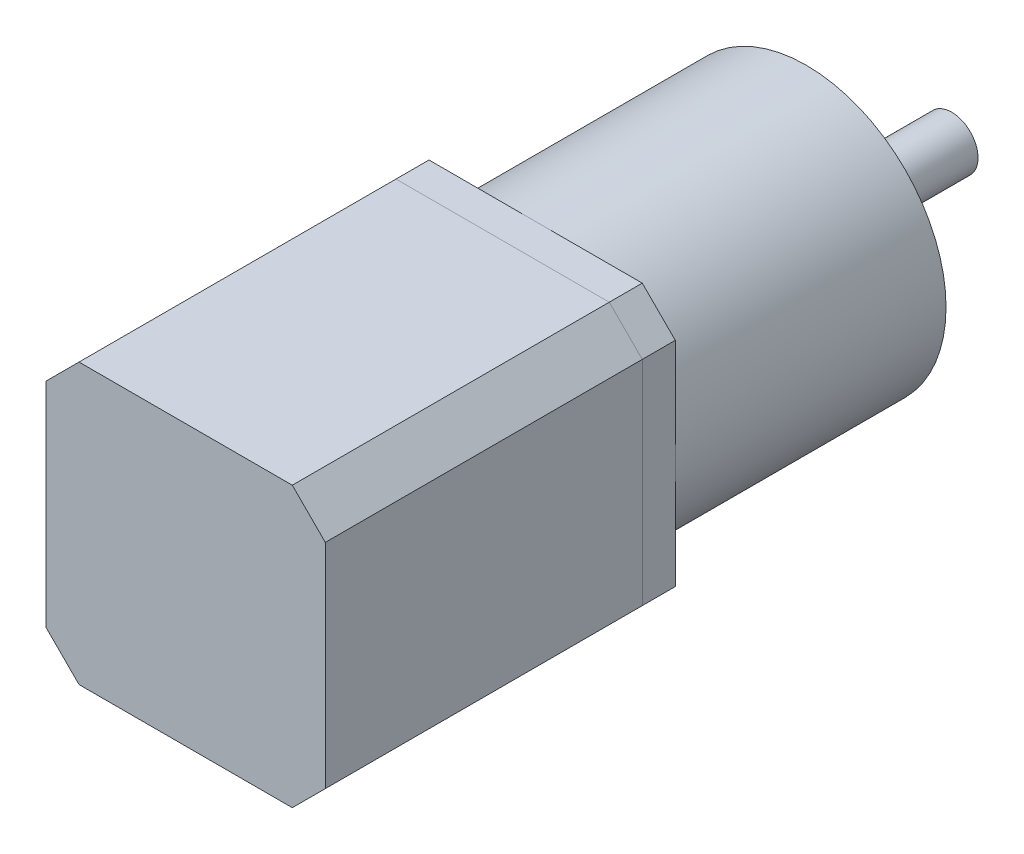
ISO-10303-21;
HEADER;
FILE_DESCRIPTION(('STEP AP214'),'2;1');
FILE_NAME('part.step','',(''),(''),'','','');
FILE_SCHEMA(('AUTOMOTIVE_DESIGN { 1 0 10303 214 1 1 1 1 }'));
ENDSEC;
DATA;
#1=APPLICATION_CONTEXT('core data for automotive mechanical design processes');
#2=APPLICATION_PROTOCOL_DEFINITION('international standard','automotive_design',2000,#1);
#3=PRODUCT_CONTEXT('',#1,'mechanical');
#4=PRODUCT('Part','Part','',(#3));
#5=PRODUCT_RELATED_PRODUCT_CATEGORY('part','',(#4));
#6=PRODUCT_DEFINITION_FORMATION('','',#4);
#7=PRODUCT_DEFINITION_CONTEXT('part definition',#1,'design');
#8=PRODUCT_DEFINITION('design','',#6,#7);
#9=PRODUCT_DEFINITION_SHAPE('','',#8);
#10=(LENGTH_UNIT() NAMED_UNIT(*) SI_UNIT(.MILLI.,.METRE.));
#11=(NAMED_UNIT(*) PLANE_ANGLE_UNIT() SI_UNIT($,.RADIAN.));
#12=(NAMED_UNIT(*) SI_UNIT($,.STERADIAN.) SOLID_ANGLE_UNIT());
#13=UNCERTAINTY_MEASURE_WITH_UNIT(LENGTH_MEASURE(1.E-05),#10,'distance_accuracy_value','');
#14=(GEOMETRIC_REPRESENTATION_CONTEXT(3) GLOBAL_UNCERTAINTY_ASSIGNED_CONTEXT((#13)) GLOBAL_UNIT_ASSIGNED_CONTEXT((#10,
#11,#12)) REPRESENTATION_CONTEXT('',''));
#15=CARTESIAN_POINT('',(0.,0.,0.));
#16=DIRECTION('',(0.,0.,1.));
#17=DIRECTION('',(1.,0.,0.));
#18=AXIS2_PLACEMENT_3D('',#15,#16,#17);
#19=CARTESIAN_POINT('',(0.,0.,-48.5));
#20=DIRECTION('',(0.,0.,1.));
#21=DIRECTION('',(1.,0.,0.));
#22=AXIS2_PLACEMENT_3D('',#19,#20,#21);
#23=CYLINDRICAL_SURFACE('',#22,6.21097509165244);
#24=CARTESIAN_POINT('',(0.,0.,-48.5));
#25=DIRECTION('',(0.,0.,-1.));
#26=DIRECTION('',(-1.,0.,0.));
#27=AXIS2_PLACEMENT_3D('',#24,#25,#26);
#28=CIRCLE('',#27,6.21097509165244);
#29=CARTESIAN_POINT('',(-6.21097509165244,0.,-48.5));
#30=VERTEX_POINT('',#29);
#31=EDGE_CURVE('E11',#30,#30,#28,.T.);
#32=ORIENTED_EDGE('',*,*,#31,.F.);
#33=EDGE_LOOP('',(#32));
#34=FACE_BOUND('',#33,.T.);
#35=CARTESIAN_POINT('',(0.,0.,-48.));
#36=DIRECTION('',(0.,0.,-1.));
#37=DIRECTION('',(-1.,0.,0.));
#38=AXIS2_PLACEMENT_3D('',#35,#36,#37);
#39=CIRCLE('',#38,6.21097509165244);
#40=CARTESIAN_POINT('',(-6.21097509165244,0.,-48.));
#41=VERTEX_POINT('',#40);
#42=EDGE_CURVE('E44',#41,#41,#39,.T.);
#43=ORIENTED_EDGE('',*,*,#42,.T.);
#44=EDGE_LOOP('',(#43));
#45=FACE_BOUND('',#44,.T.);
#46=ADVANCED_FACE('F41',(#34,#45),#23,.T.);
#47=CARTESIAN_POINT('',(0.,0.,-48.5));
#48=DIRECTION('',(0.,0.,-1.));
#49=DIRECTION('',(-1.,0.,0.));
#50=AXIS2_PLACEMENT_3D('',#47,#48,#49);
#51=PLANE('',#50);
#52=ORIENTED_EDGE('',*,*,#31,.T.);
#53=EDGE_LOOP('',(#52));
#54=FACE_BOUND('',#53,.T.);
#55=ADVANCED_FACE('F56',(#54),#51,.T.);
#56=CARTESIAN_POINT('',(0.,0.,-48.));
#57=DIRECTION('',(0.,0.,-1.));
#58=DIRECTION('',(-1.,0.,0.));
#59=AXIS2_PLACEMENT_3D('',#56,#57,#58);
#60=PLANE('',#59);
#61=ORIENTED_EDGE('',*,*,#42,.F.);
#62=EDGE_LOOP('',(#61));
#63=FACE_BOUND('',#62,.T.);
#64=ADVANCED_FACE('F54',(#63),#60,.F.);
#65=CLOSED_SHELL('',(#46,#55,#64));
#66=MANIFOLD_SOLID_BREP('B2',#65);
#67=CARTESIAN_POINT('',(0.,0.,-68.));
#68=DIRECTION('',(0.,0.,1.));
#69=DIRECTION('',(1.,0.,0.));
#70=AXIS2_PLACEMENT_3D('',#67,#68,#69);
#71=CYLINDRICAL_SURFACE('',#70,4.);
#72=CARTESIAN_POINT('',(0.,0.,-68.));
#73=DIRECTION('',(0.,0.,-1.));
#74=DIRECTION('',(-1.,0.,0.));
#75=AXIS2_PLACEMENT_3D('',#72,#73,#74);
#76=CIRCLE('',#75,4.);
#77=CARTESIAN_POINT('',(-4.,0.,-68.));
#78=VERTEX_POINT('',#77);
#79=EDGE_CURVE('E40',#78,#78,#76,.T.);
#80=ORIENTED_EDGE('',*,*,#79,.F.);
#81=EDGE_LOOP('',(#80));
#82=FACE_BOUND('',#81,.T.);
#83=CARTESIAN_POINT('',(0.,0.,-48.));
#84=DIRECTION('',(0.,0.,-1.));
#85=DIRECTION('',(-1.,0.,0.));
#86=AXIS2_PLACEMENT_3D('',#83,#84,#85);
#87=CIRCLE('',#86,4.);
#88=CARTESIAN_POINT('',(-4.,0.,-48.));
#89=VERTEX_POINT('',#88);
#90=EDGE_CURVE('E92',#89,#89,#87,.T.);
#91=ORIENTED_EDGE('',*,*,#90,.T.);
#92=EDGE_LOOP('',(#91));
#93=FACE_BOUND('',#92,.T.);
#94=ADVANCED_FACE('F89',(#82,#93),#71,.T.);
#95=CARTESIAN_POINT('',(0.,0.,-68.));
#96=DIRECTION('',(0.,0.,-1.));
#97=DIRECTION('',(-1.,0.,0.));
#98=AXIS2_PLACEMENT_3D('',#95,#96,#97);
#99=PLANE('',#98);
#100=ORIENTED_EDGE('',*,*,#79,.T.);
#101=EDGE_LOOP('',(#100));
#102=FACE_BOUND('',#101,.T.);
#103=ADVANCED_FACE('F104',(#102),#99,.T.);
#104=CARTESIAN_POINT('',(0.,0.,-48.));
#105=DIRECTION('',(0.,0.,-1.));
#106=DIRECTION('',(-1.,0.,0.));
#107=AXIS2_PLACEMENT_3D('',#104,#105,#106);
#108=PLANE('',#107);
#109=ORIENTED_EDGE('',*,*,#90,.F.);
#110=EDGE_LOOP('',(#109));
#111=FACE_BOUND('',#110,.T.);
#112=ADVANCED_FACE('F102',(#111),#108,.F.);
#113=CLOSED_SHELL('',(#94,#103,#112));
#114=MANIFOLD_SOLID_BREP('B6',#113);
#115=CARTESIAN_POINT('',(0.,0.,-48.));
#116=DIRECTION('',(0.,0.,1.));
#117=DIRECTION('',(1.,0.,0.));
#118=AXIS2_PLACEMENT_3D('',#115,#116,#117);
#119=CYLINDRICAL_SURFACE('',#118,11.);
#120=CARTESIAN_POINT('',(0.,0.,-48.));
#121=DIRECTION('',(0.,0.,-1.));
#122=DIRECTION('',(-1.,0.,0.));
#123=AXIS2_PLACEMENT_3D('',#120,#121,#122);
#124=CIRCLE('',#123,11.);
#125=CARTESIAN_POINT('',(-11.,0.,-48.));
#126=VERTEX_POINT('',#125);
#127=EDGE_CURVE('E88',#126,#126,#124,.T.);
#128=ORIENTED_EDGE('',*,*,#127,.F.);
#129=EDGE_LOOP('',(#128));
#130=FACE_BOUND('',#129,.T.);
#131=CARTESIAN_POINT('',(0.,0.,-46.));
#132=DIRECTION('',(0.,0.,-1.));
#133=DIRECTION('',(-1.,0.,0.));
#134=AXIS2_PLACEMENT_3D('',#131,#132,#133);
#135=CIRCLE('',#134,11.);
#136=CARTESIAN_POINT('',(-11.,0.,-46.));
#137=VERTEX_POINT('',#136);
#138=EDGE_CURVE('E140',#137,#137,#135,.T.);
#139=ORIENTED_EDGE('',*,*,#138,.T.);
#140=EDGE_LOOP('',(#139));
#141=FACE_BOUND('',#140,.T.);
#142=ADVANCED_FACE('F137',(#130,#141),#119,.T.);
#143=CARTESIAN_POINT('',(0.,0.,-48.));
#144=DIRECTION('',(0.,0.,-1.));
#145=DIRECTION('',(-1.,0.,0.));
#146=AXIS2_PLACEMENT_3D('',#143,#144,#145);
#147=PLANE('',#146);
#148=ORIENTED_EDGE('',*,*,#127,.T.);
#149=EDGE_LOOP('',(#148));
#150=FACE_BOUND('',#149,.T.);
#151=ADVANCED_FACE('F152',(#150),#147,.T.);
#152=CARTESIAN_POINT('',(0.,0.,-46.));
#153=DIRECTION('',(0.,0.,-1.));
#154=DIRECTION('',(-1.,0.,0.));
#155=AXIS2_PLACEMENT_3D('',#152,#153,#154);
#156=PLANE('',#155);
#157=ORIENTED_EDGE('',*,*,#138,.F.);
#158=EDGE_LOOP('',(#157));
#159=FACE_BOUND('',#158,.T.);
#160=ADVANCED_FACE('F150',(#159),#156,.F.);
#161=CLOSED_SHELL('',(#142,#151,#160));
#162=MANIFOLD_SOLID_BREP('B35',#161);
#163=CARTESIAN_POINT('',(0.,0.,-46.));
#164=DIRECTION('',(0.,0.,1.));
#165=DIRECTION('',(1.,0.,0.));
#166=AXIS2_PLACEMENT_3D('',#163,#164,#165);
#167=CYLINDRICAL_SURFACE('',#166,21.15);
#168=CARTESIAN_POINT('',(0.,0.,-46.));
#169=DIRECTION('',(0.,0.,-1.));
#170=DIRECTION('',(-1.,0.,0.));
#171=AXIS2_PLACEMENT_3D('',#168,#169,#170);
#172=CIRCLE('',#171,21.15);
#173=CARTESIAN_POINT('',(-21.15,0.,-46.));
#174=VERTEX_POINT('',#173);
#175=EDGE_CURVE('E136',#174,#174,#172,.T.);
#176=ORIENTED_EDGE('',*,*,#175,.F.);
#177=EDGE_LOOP('',(#176));
#178=FACE_BOUND('',#177,.T.);
#179=CARTESIAN_POINT('',(0.,0.,-5.));
#180=DIRECTION('',(0.,0.,-1.));
#181=DIRECTION('',(-1.,0.,0.));
#182=AXIS2_PLACEMENT_3D('',#179,#180,#181);
#183=CIRCLE('',#182,21.15);
#184=CARTESIAN_POINT('',(-21.15,0.,-5.));
#185=VERTEX_POINT('',#184);
#186=EDGE_CURVE('E190',#185,#185,#183,.T.);
#187=ORIENTED_EDGE('',*,*,#186,.T.);
#188=EDGE_LOOP('',(#187));
#189=FACE_BOUND('',#188,.T.);
#190=ADVANCED_FACE('F187',(#178,#189),#167,.T.);
#191=CARTESIAN_POINT('',(0.,0.,-46.));
#192=DIRECTION('',(0.,0.,-1.));
#193=DIRECTION('',(-1.,0.,0.));
#194=AXIS2_PLACEMENT_3D('',#191,#192,#193);
#195=PLANE('',#194);
#196=CARTESIAN_POINT('',(17.5,0.,-46.));
#197=DIRECTION('',(0.,0.,-1.));
#198=DIRECTION('',(-1.,0.,0.));
#199=AXIS2_PLACEMENT_3D('',#196,#197,#198);
#200=CIRCLE('',#199,1.5);
#201=CARTESIAN_POINT('',(16.,0.,-46.));
#202=VERTEX_POINT('',#201);
#203=EDGE_CURVE('E217',#202,#202,#200,.T.);
#204=ORIENTED_EDGE('',*,*,#203,.F.);
#205=EDGE_LOOP('',(#204));
#206=FACE_BOUND('',#205,.T.);
#207=CARTESIAN_POINT('',(0.,17.5,-46.));
#208=DIRECTION('',(0.,0.,-1.));
#209=DIRECTION('',(-1.,0.,0.));
#210=AXIS2_PLACEMENT_3D('',#207,#208,#209);
#211=CIRCLE('',#210,1.5);
#212=CARTESIAN_POINT('',(-1.50000000000006,17.5,-46.));
#213=VERTEX_POINT('',#212);
#214=EDGE_CURVE('E211',#213,#213,#211,.T.);
#215=ORIENTED_EDGE('',*,*,#214,.F.);
#216=EDGE_LOOP('',(#215));
#217=FACE_BOUND('',#216,.T.);
#218=CARTESIAN_POINT('',(-17.5,-1.2220184685951E-13,-46.));
#219=DIRECTION('',(0.,0.,-1.));
#220=DIRECTION('',(-1.,0.,0.));
#221=AXIS2_PLACEMENT_3D('',#218,#219,#220);
#222=CIRCLE('',#221,1.5);
#223=CARTESIAN_POINT('',(-19.,-1.2220184685951E-13,-46.));
#224=VERTEX_POINT('',#223);
#225=EDGE_CURVE('E205',#224,#224,#222,.T.);
#226=ORIENTED_EDGE('',*,*,#225,.F.);
#227=EDGE_LOOP('',(#226));
#228=FACE_BOUND('',#227,.T.);
#229=CARTESIAN_POINT('',(1.83302770289265E-13,-17.5,-46.));
#230=DIRECTION('',(0.,0.,-1.));
#231=DIRECTION('',(-1.,0.,0.));
#232=AXIS2_PLACEMENT_3D('',#229,#230,#231);
#233=CIRCLE('',#232,1.5);
#234=CARTESIAN_POINT('',(-1.49999999999982,-17.5,-46.));
#235=VERTEX_POINT('',#234);
#236=EDGE_CURVE('E199',#235,#235,#233,.T.);
#237=ORIENTED_EDGE('',*,*,#236,.F.);
#238=EDGE_LOOP('',(#237));
#239=FACE_BOUND('',#238,.T.);
#240=ORIENTED_EDGE('',*,*,#175,.T.);
#241=EDGE_LOOP('',(#240));
#242=FACE_BOUND('',#241,.T.);
#243=ADVANCED_FACE('F232',(#206,#217,#228,#239,#242),#195,.T.);
#244=CARTESIAN_POINT('',(0.,0.,-5.));
#245=DIRECTION('',(0.,0.,-1.));
#246=DIRECTION('',(-1.,0.,0.));
#247=AXIS2_PLACEMENT_3D('',#244,#245,#246);
#248=PLANE('',#247);
#249=ORIENTED_EDGE('',*,*,#186,.F.);
#250=EDGE_LOOP('',(#249));
#251=FACE_BOUND('',#250,.T.);
#252=ADVANCED_FACE('F235',(#251),#248,.F.);
#253=CARTESIAN_POINT('',(1.83302770289265E-13,-17.5,-36.));
#254=DIRECTION('',(0.,0.,-1.));
#255=DIRECTION('',(-1.,0.,0.));
#256=AXIS2_PLACEMENT_3D('',#253,#254,#255);
#257=CYLINDRICAL_SURFACE('',#256,1.5);
#258=CARTESIAN_POINT('',(1.83302770289265E-13,-17.5,-36.));
#259=DIRECTION('',(0.,0.,-1.));
#260=DIRECTION('',(-1.,0.,0.));
#261=AXIS2_PLACEMENT_3D('',#258,#259,#260);
#262=CIRCLE('',#261,1.5);
#263=CARTESIAN_POINT('',(-1.49999999999982,-17.5,-36.));
#264=VERTEX_POINT('',#263);
#265=EDGE_CURVE('E202',#264,#264,#262,.T.);
#266=ORIENTED_EDGE('',*,*,#265,.F.);
#267=EDGE_LOOP('',(#266));
#268=FACE_BOUND('',#267,.T.);
#269=ORIENTED_EDGE('',*,*,#236,.T.);
#270=EDGE_LOOP('',(#269));
#271=FACE_BOUND('',#270,.T.);
#272=ADVANCED_FACE('F243',(#268,#271),#257,.F.);
#273=CARTESIAN_POINT('',(1.83302770289265E-13,-17.5,-36.));
#274=DIRECTION('',(0.,0.,-1.));
#275=DIRECTION('',(-1.,0.,0.));
#276=AXIS2_PLACEMENT_3D('',#273,#274,#275);
#277=PLANE('',#276);
#278=ORIENTED_EDGE('',*,*,#265,.T.);
#279=EDGE_LOOP('',(#278));
#280=FACE_BOUND('',#279,.T.);
#281=ADVANCED_FACE('F245',(#280),#277,.T.);
#282=CARTESIAN_POINT('',(-17.5,-1.2220184685951E-13,-36.));
#283=DIRECTION('',(0.,0.,-1.));
#284=DIRECTION('',(-1.,0.,0.));
#285=AXIS2_PLACEMENT_3D('',#282,#283,#284);
#286=CYLINDRICAL_SURFACE('',#285,1.5);
#287=CARTESIAN_POINT('',(-17.5,-1.2220184685951E-13,-36.));
#288=DIRECTION('',(0.,0.,-1.));
#289=DIRECTION('',(-1.,0.,0.));
#290=AXIS2_PLACEMENT_3D('',#287,#288,#289);
#291=CIRCLE('',#290,1.5);
#292=CARTESIAN_POINT('',(-19.,-1.2220184685951E-13,-36.));
#293=VERTEX_POINT('',#292);
#294=EDGE_CURVE('E208',#293,#293,#291,.T.);
#295=ORIENTED_EDGE('',*,*,#294,.F.);
#296=EDGE_LOOP('',(#295));
#297=FACE_BOUND('',#296,.T.);
#298=ORIENTED_EDGE('',*,*,#225,.T.);
#299=EDGE_LOOP('',(#298));
#300=FACE_BOUND('',#299,.T.);
#301=ADVANCED_FACE('F252',(#297,#300),#286,.F.);
#302=CARTESIAN_POINT('',(-17.5,-1.2220184685951E-13,-36.));
#303=DIRECTION('',(0.,0.,-1.));
#304=DIRECTION('',(-1.,0.,0.));
#305=AXIS2_PLACEMENT_3D('',#302,#303,#304);
#306=PLANE('',#305);
#307=ORIENTED_EDGE('',*,*,#294,.T.);
#308=EDGE_LOOP('',(#307));
#309=FACE_BOUND('',#308,.T.);
#310=ADVANCED_FACE('F292',(#309),#306,.T.);
#311=CARTESIAN_POINT('',(0.,17.5,-36.));
#312=DIRECTION('',(0.,0.,-1.));
#313=DIRECTION('',(-1.,0.,0.));
#314=AXIS2_PLACEMENT_3D('',#311,#312,#313);
#315=CYLINDRICAL_SURFACE('',#314,1.5);
#316=CARTESIAN_POINT('',(0.,17.5,-36.));
#317=DIRECTION('',(0.,0.,-1.));
#318=DIRECTION('',(-1.,0.,0.));
#319=AXIS2_PLACEMENT_3D('',#316,#317,#318);
#320=CIRCLE('',#319,1.5);
#321=CARTESIAN_POINT('',(-1.50000000000006,17.5,-36.));
#322=VERTEX_POINT('',#321);
#323=EDGE_CURVE('E214',#322,#322,#320,.T.);
#324=ORIENTED_EDGE('',*,*,#323,.F.);
#325=EDGE_LOOP('',(#324));
#326=FACE_BOUND('',#325,.T.);
#327=ORIENTED_EDGE('',*,*,#214,.T.);
#328=EDGE_LOOP('',(#327));
#329=FACE_BOUND('',#328,.T.);
#330=ADVANCED_FACE('F301',(#326,#329),#315,.F.);
#331=CARTESIAN_POINT('',(0.,17.5,-36.));
#332=DIRECTION('',(0.,0.,-1.));
#333=DIRECTION('',(-1.,0.,0.));
#334=AXIS2_PLACEMENT_3D('',#331,#332,#333);
#335=PLANE('',#334);
#336=ORIENTED_EDGE('',*,*,#323,.T.);
#337=EDGE_LOOP('',(#336));
#338=FACE_BOUND('',#337,.T.);
#339=ADVANCED_FACE('F228',(#338),#335,.T.);
#340=CARTESIAN_POINT('',(17.5,0.,-36.));
#341=DIRECTION('',(0.,0.,-1.));
#342=DIRECTION('',(-1.,0.,0.));
#343=AXIS2_PLACEMENT_3D('',#340,#341,#342);
#344=CYLINDRICAL_SURFACE('',#343,1.5);
#345=CARTESIAN_POINT('',(17.5,0.,-36.));
#346=DIRECTION('',(0.,0.,-1.));
#347=DIRECTION('',(-1.,0.,0.));
#348=AXIS2_PLACEMENT_3D('',#345,#346,#347);
#349=CIRCLE('',#348,1.5);
#350=CARTESIAN_POINT('',(16.,0.,-36.));
#351=VERTEX_POINT('',#350);
#352=EDGE_CURVE('E197',#351,#351,#349,.T.);
#353=ORIENTED_EDGE('',*,*,#352,.F.);
#354=EDGE_LOOP('',(#353));
#355=FACE_BOUND('',#354,.T.);
#356=ORIENTED_EDGE('',*,*,#203,.T.);
#357=EDGE_LOOP('',(#356));
#358=FACE_BOUND('',#357,.T.);
#359=ADVANCED_FACE('F225',(#355,#358),#344,.F.);
#360=CARTESIAN_POINT('',(17.5,0.,-36.));
#361=DIRECTION('',(0.,0.,-1.));
#362=DIRECTION('',(-1.,0.,0.));
#363=AXIS2_PLACEMENT_3D('',#360,#361,#362);
#364=PLANE('',#363);
#365=ORIENTED_EDGE('',*,*,#352,.T.);
#366=EDGE_LOOP('',(#365));
#367=FACE_BOUND('',#366,.T.);
#368=ADVANCED_FACE('F223',(#367),#364,.T.);
#369=CLOSED_SHELL('',(#190,#243,#252,#272,#281,#301,#310,#330,#339,#359,#368));
#370=MANIFOLD_SOLID_BREP('B83',#369);
#371=CARTESIAN_POINT('',(-21.15,-21.15,-5.));
#372=DIRECTION('',(1.,0.,0.));
#373=DIRECTION('',(0.,0.,-1.));
#374=AXIS2_PLACEMENT_3D('',#371,#372,#373);
#375=PLANE('',#374);
#376=DIRECTION('',(0.,1.,0.));
#377=VECTOR('',#376,1.);
#378=CARTESIAN_POINT('',(-21.15,-21.15,-5.));
#379=LINE('',#378,#377);
#380=CARTESIAN_POINT('',(-21.15,-16.15,-5.));
#381=VERTEX_POINT('',#380);
#382=CARTESIAN_POINT('',(-21.15,16.15,-5.));
#383=VERTEX_POINT('',#382);
#384=EDGE_CURVE('E447',#381,#383,#379,.T.);
#385=ORIENTED_EDGE('',*,*,#384,.F.);
#386=DIRECTION('',(0.,0.,1.));
#387=VECTOR('',#386,1.);
#388=CARTESIAN_POINT('',(-21.15,-16.15,-5.));
#389=LINE('',#388,#387);
#390=CARTESIAN_POINT('',(-21.15,-16.15,0.));
#391=VERTEX_POINT('',#390);
#392=EDGE_CURVE('E473',#381,#391,#389,.T.);
#393=ORIENTED_EDGE('',*,*,#392,.T.);
#394=DIRECTION('',(0.,1.,0.));
#395=VECTOR('',#394,1.);
#396=CARTESIAN_POINT('',(-21.15,-21.15,0.));
#397=LINE('',#396,#395);
#398=CARTESIAN_POINT('',(-21.15,16.15,0.));
#399=VERTEX_POINT('',#398);
#400=EDGE_CURVE('E481',#391,#399,#397,.T.);
#401=ORIENTED_EDGE('',*,*,#400,.T.);
#402=DIRECTION('',(0.,0.,-1.));
#403=VECTOR('',#402,1.);
#404=CARTESIAN_POINT('',(-21.15,16.15,-5.));
#405=LINE('',#404,#403);
#406=EDGE_CURVE('E471',#399,#383,#405,.T.);
#407=ORIENTED_EDGE('',*,*,#406,.T.);
#408=EDGE_LOOP('',(#385,#393,#401,#407));
#409=FACE_BOUND('',#408,.T.);
#410=ADVANCED_FACE('F356',(#409),#375,.F.);
#411=CARTESIAN_POINT('',(21.15,21.15,-5.));
#412=DIRECTION('',(0.,-1.,0.));
#413=DIRECTION('',(0.,0.,-1.));
#414=AXIS2_PLACEMENT_3D('',#411,#412,#413);
#415=PLANE('',#414);
#416=DIRECTION('',(1.,0.,0.));
#417=VECTOR('',#416,1.);
#418=CARTESIAN_POINT('',(21.15,21.15,0.));
#419=LINE('',#418,#417);
#420=CARTESIAN_POINT('',(-16.15,21.15,0.));
#421=VERTEX_POINT('',#420);
#422=CARTESIAN_POINT('',(16.15,21.15,0.));
#423=VERTEX_POINT('',#422);
#424=EDGE_CURVE('E452',#421,#423,#419,.T.);
#425=ORIENTED_EDGE('',*,*,#424,.T.);
#426=DIRECTION('',(0.,0.,-1.));
#427=VECTOR('',#426,1.);
#428=CARTESIAN_POINT('',(16.15,21.15,-5.));
#429=LINE('',#428,#427);
#430=CARTESIAN_POINT('',(16.15,21.15,-5.));
#431=VERTEX_POINT('',#430);
#432=EDGE_CURVE('E185',#423,#431,#429,.T.);
#433=ORIENTED_EDGE('',*,*,#432,.T.);
#434=DIRECTION('',(1.,0.,0.));
#435=VECTOR('',#434,1.);
#436=CARTESIAN_POINT('',(21.15,21.15,-5.));
#437=LINE('',#436,#435);
#438=CARTESIAN_POINT('',(-16.15,21.15,-5.));
#439=VERTEX_POINT('',#438);
#440=EDGE_CURVE('E450',#439,#431,#437,.T.);
#441=ORIENTED_EDGE('',*,*,#440,.F.);
#442=DIRECTION('',(0.,0.,1.));
#443=VECTOR('',#442,1.);
#444=CARTESIAN_POINT('',(-16.15,21.15,-5.));
#445=LINE('',#444,#443);
#446=EDGE_CURVE('E364',#439,#421,#445,.T.);
#447=ORIENTED_EDGE('',*,*,#446,.T.);
#448=EDGE_LOOP('',(#425,#433,#441,#447));
#449=FACE_BOUND('',#448,.T.);
#450=ADVANCED_FACE('F478',(#449),#415,.F.);
#451=CARTESIAN_POINT('',(21.15,-21.15,-5.));
#452=DIRECTION('',(-1.,0.,0.));
#453=DIRECTION('',(0.,0.,1.));
#454=AXIS2_PLACEMENT_3D('',#451,#452,#453);
#455=PLANE('',#454);
#456=DIRECTION('',(0.,-1.,0.));
#457=VECTOR('',#456,1.);
#458=CARTESIAN_POINT('',(21.15,-21.15,0.));
#459=LINE('',#458,#457);
#460=CARTESIAN_POINT('',(21.15,16.15,0.));
#461=VERTEX_POINT('',#460);
#462=CARTESIAN_POINT('',(21.15,-16.15,0.));
#463=VERTEX_POINT('',#462);
#464=EDGE_CURVE('E448',#461,#463,#459,.T.);
#465=ORIENTED_EDGE('',*,*,#464,.T.);
#466=DIRECTION('',(0.,0.,-1.));
#467=VECTOR('',#466,1.);
#468=CARTESIAN_POINT('',(21.15,-16.15,-5.));
#469=LINE('',#468,#467);
#470=CARTESIAN_POINT('',(21.15,-16.15,-5.));
#471=VERTEX_POINT('',#470);
#472=EDGE_CURVE('E426',#463,#471,#469,.T.);
#473=ORIENTED_EDGE('',*,*,#472,.T.);
#474=DIRECTION('',(0.,-1.,0.));
#475=VECTOR('',#474,1.);
#476=CARTESIAN_POINT('',(21.15,-21.15,-5.));
#477=LINE('',#476,#475);
#478=CARTESIAN_POINT('',(21.15,16.15,-5.));
#479=VERTEX_POINT('',#478);
#480=EDGE_CURVE('E485',#479,#471,#477,.T.);
#481=ORIENTED_EDGE('',*,*,#480,.F.);
#482=DIRECTION('',(0.,0.,1.));
#483=VECTOR('',#482,1.);
#484=CARTESIAN_POINT('',(21.15,16.15,-5.));
#485=LINE('',#484,#483);
#486=EDGE_CURVE('E431',#479,#461,#485,.T.);
#487=ORIENTED_EDGE('',*,*,#486,.T.);
#488=EDGE_LOOP('',(#465,#473,#481,#487));
#489=FACE_BOUND('',#488,.T.);
#490=ADVANCED_FACE('F495',(#489),#455,.F.);
#491=CARTESIAN_POINT('',(21.15,-21.15,-5.));
#492=DIRECTION('',(0.,1.,0.));
#493=DIRECTION('',(0.,0.,1.));
#494=AXIS2_PLACEMENT_3D('',#491,#492,#493);
#495=PLANE('',#494);
#496=DIRECTION('',(-1.,0.,0.));
#497=VECTOR('',#496,1.);
#498=CARTESIAN_POINT('',(21.15,-21.15,-5.));
#499=LINE('',#498,#497);
#500=CARTESIAN_POINT('',(16.15,-21.15,-5.));
#501=VERTEX_POINT('',#500);
#502=CARTESIAN_POINT('',(-16.15,-21.15,-5.));
#503=VERTEX_POINT('',#502);
#504=EDGE_CURVE('E441',#501,#503,#499,.T.);
#505=ORIENTED_EDGE('',*,*,#504,.F.);
#506=DIRECTION('',(0.,0.,1.));
#507=VECTOR('',#506,1.);
#508=CARTESIAN_POINT('',(16.15,-21.15,-5.));
#509=LINE('',#508,#507);
#510=CARTESIAN_POINT('',(16.15,-21.15,0.));
#511=VERTEX_POINT('',#510);
#512=EDGE_CURVE('E425',#501,#511,#509,.T.);
#513=ORIENTED_EDGE('',*,*,#512,.T.);
#514=DIRECTION('',(-1.,0.,0.));
#515=VECTOR('',#514,1.);
#516=CARTESIAN_POINT('',(21.15,-21.15,0.));
#517=LINE('',#516,#515);
#518=CARTESIAN_POINT('',(-16.15,-21.15,0.));
#519=VERTEX_POINT('',#518);
#520=EDGE_CURVE('E438',#511,#519,#517,.T.);
#521=ORIENTED_EDGE('',*,*,#520,.T.);
#522=DIRECTION('',(0.,0.,-1.));
#523=VECTOR('',#522,1.);
#524=CARTESIAN_POINT('',(-16.15,-21.15,-5.));
#525=LINE('',#524,#523);
#526=EDGE_CURVE('E443',#519,#503,#525,.T.);
#527=ORIENTED_EDGE('',*,*,#526,.T.);
#528=EDGE_LOOP('',(#505,#513,#521,#527));
#529=FACE_BOUND('',#528,.T.);
#530=ADVANCED_FACE('F437',(#529),#495,.F.);
#531=CARTESIAN_POINT('',(0.,0.,-5.));
#532=DIRECTION('',(0.,0.,1.));
#533=DIRECTION('',(1.,0.,0.));
#534=AXIS2_PLACEMENT_3D('',#531,#532,#533);
#535=PLANE('',#534);
#536=ORIENTED_EDGE('',*,*,#480,.T.);
#537=DIRECTION('',(0.707106781186546,0.707106781186549,0.));
#538=VECTOR('',#537,1.);
#539=CARTESIAN_POINT('',(16.15,-21.15,-5.));
#540=LINE('',#539,#538);
#541=EDGE_CURVE('E469',#471,#501,#540,.F.);
#542=ORIENTED_EDGE('',*,*,#541,.T.);
#543=ORIENTED_EDGE('',*,*,#504,.T.);
#544=DIRECTION('',(0.707106781186549,-0.707106781186546,0.));
#545=VECTOR('',#544,1.);
#546=CARTESIAN_POINT('',(-21.15,-16.15,-5.));
#547=LINE('',#546,#545);
#548=EDGE_CURVE('E467',#503,#381,#547,.F.);
#549=ORIENTED_EDGE('',*,*,#548,.T.);
#550=ORIENTED_EDGE('',*,*,#384,.T.);
#551=DIRECTION('',(-0.707106781186546,-0.707106781186549,0.));
#552=VECTOR('',#551,1.);
#553=CARTESIAN_POINT('',(-16.15,21.15,-5.));
#554=LINE('',#553,#552);
#555=EDGE_CURVE('E376',#383,#439,#554,.F.);
#556=ORIENTED_EDGE('',*,*,#555,.T.);
#557=ORIENTED_EDGE('',*,*,#440,.T.);
#558=DIRECTION('',(-0.707106781186549,0.707106781186546,0.));
#559=VECTOR('',#558,1.);
#560=CARTESIAN_POINT('',(21.15,16.15,-5.));
#561=LINE('',#560,#559);
#562=EDGE_CURVE('E465',#431,#479,#561,.F.);
#563=ORIENTED_EDGE('',*,*,#562,.T.);
#564=EDGE_LOOP('',(#536,#542,#543,#549,#550,#556,#557,#563));
#565=FACE_BOUND('',#564,.T.);
#566=ADVANCED_FACE('F489',(#565),#535,.F.);
#567=CARTESIAN_POINT('',(0.,0.,0.));
#568=DIRECTION('',(0.,0.,1.));
#569=DIRECTION('',(1.,0.,0.));
#570=AXIS2_PLACEMENT_3D('',#567,#568,#569);
#571=PLANE('',#570);
#572=ORIENTED_EDGE('',*,*,#520,.F.);
#573=DIRECTION('',(-0.707106781186546,-0.707106781186549,0.));
#574=VECTOR('',#573,1.);
#575=CARTESIAN_POINT('',(18.65,-18.65,0.));
#576=LINE('',#575,#574);
#577=EDGE_CURVE('E421',#511,#463,#576,.F.);
#578=ORIENTED_EDGE('',*,*,#577,.T.);
#579=ORIENTED_EDGE('',*,*,#464,.F.);
#580=DIRECTION('',(0.707106781186549,-0.707106781186546,0.));
#581=VECTOR('',#580,1.);
#582=CARTESIAN_POINT('',(18.65,18.65,0.));
#583=LINE('',#582,#581);
#584=EDGE_CURVE('E458',#461,#423,#583,.F.);
#585=ORIENTED_EDGE('',*,*,#584,.T.);
#586=ORIENTED_EDGE('',*,*,#424,.F.);
#587=DIRECTION('',(0.707106781186546,0.707106781186549,0.));
#588=VECTOR('',#587,1.);
#589=CARTESIAN_POINT('',(-18.65,18.65,0.));
#590=LINE('',#589,#588);
#591=EDGE_CURVE('E442',#421,#399,#590,.F.);
#592=ORIENTED_EDGE('',*,*,#591,.T.);
#593=ORIENTED_EDGE('',*,*,#400,.F.);
#594=DIRECTION('',(-0.707106781186549,0.707106781186546,0.));
#595=VECTOR('',#594,1.);
#596=CARTESIAN_POINT('',(-18.65,-18.65,0.));
#597=LINE('',#596,#595);
#598=EDGE_CURVE('E432',#391,#519,#597,.F.);
#599=ORIENTED_EDGE('',*,*,#598,.T.);
#600=EDGE_LOOP('',(#572,#578,#579,#585,#586,#592,#593,#599));
#601=FACE_BOUND('',#600,.T.);
#602=ADVANCED_FACE('F445',(#601),#571,.T.);
#603=CARTESIAN_POINT('',(16.15,-21.15,-5.));
#604=DIRECTION('',(-0.707106781186549,0.707106781186546,0.));
#605=DIRECTION('',(0.,0.,1.));
#606=AXIS2_PLACEMENT_3D('',#603,#604,#605);
#607=PLANE('',#606);
#608=ORIENTED_EDGE('',*,*,#541,.F.);
#609=ORIENTED_EDGE('',*,*,#472,.F.);
#610=ORIENTED_EDGE('',*,*,#577,.F.);
#611=ORIENTED_EDGE('',*,*,#512,.F.);
#612=EDGE_LOOP('',(#608,#609,#610,#611));
#613=FACE_BOUND('',#612,.T.);
#614=ADVANCED_FACE('F424',(#613),#607,.F.);
#615=CARTESIAN_POINT('',(-21.15,-16.15,-5.));
#616=DIRECTION('',(0.707106781186546,0.707106781186549,0.));
#617=DIRECTION('',(0.,0.,1.));
#618=AXIS2_PLACEMENT_3D('',#615,#616,#617);
#619=PLANE('',#618);
#620=ORIENTED_EDGE('',*,*,#548,.F.);
#621=ORIENTED_EDGE('',*,*,#526,.F.);
#622=ORIENTED_EDGE('',*,*,#598,.F.);
#623=ORIENTED_EDGE('',*,*,#392,.F.);
#624=EDGE_LOOP('',(#620,#621,#622,#623));
#625=FACE_BOUND('',#624,.T.);
#626=ADVANCED_FACE('F500',(#625),#619,.F.);
#627=CARTESIAN_POINT('',(21.15,16.15,-5.));
#628=DIRECTION('',(-0.707106781186546,-0.707106781186549,0.));
#629=DIRECTION('',(0.,0.,1.));
#630=AXIS2_PLACEMENT_3D('',#627,#628,#629);
#631=PLANE('',#630);
#632=ORIENTED_EDGE('',*,*,#562,.F.);
#633=ORIENTED_EDGE('',*,*,#432,.F.);
#634=ORIENTED_EDGE('',*,*,#584,.F.);
#635=ORIENTED_EDGE('',*,*,#486,.F.);
#636=EDGE_LOOP('',(#632,#633,#634,#635));
#637=FACE_BOUND('',#636,.T.);
#638=ADVANCED_FACE('F493',(#637),#631,.F.);
#639=CARTESIAN_POINT('',(-16.15,21.15,-5.));
#640=DIRECTION('',(0.707106781186549,-0.707106781186546,0.));
#641=DIRECTION('',(0.,0.,1.));
#642=AXIS2_PLACEMENT_3D('',#639,#640,#641);
#643=PLANE('',#642);
#644=ORIENTED_EDGE('',*,*,#555,.F.);
#645=ORIENTED_EDGE('',*,*,#406,.F.);
#646=ORIENTED_EDGE('',*,*,#591,.F.);
#647=ORIENTED_EDGE('',*,*,#446,.F.);
#648=EDGE_LOOP('',(#644,#645,#646,#647));
#649=FACE_BOUND('',#648,.T.);
#650=ADVANCED_FACE('F358',(#649),#643,.F.);
#651=CLOSED_SHELL('',(#410,#450,#490,#530,#566,#602,#614,#626,#638,#650));
#652=MANIFOLD_SOLID_BREP('B131',#651);
#653=CARTESIAN_POINT('',(21.15,21.15,48.));
#654=DIRECTION('',(-1.,0.,0.));
#655=DIRECTION('',(0.,-1.,0.));
#656=AXIS2_PLACEMENT_3D('',#653,#654,#655);
#657=PLANE('',#656);
#658=DIRECTION('',(0.,1.,0.));
#659=VECTOR('',#658,1.);
#660=CARTESIAN_POINT('',(21.15,21.15,48.));
#661=LINE('',#660,#659);
#662=CARTESIAN_POINT('',(21.15,-16.15,48.));
#663=VERTEX_POINT('',#662);
#664=CARTESIAN_POINT('',(21.15,16.15,48.));
#665=VERTEX_POINT('',#664);
#666=EDGE_CURVE('E674',#663,#665,#661,.T.);
#667=ORIENTED_EDGE('',*,*,#666,.F.);
#668=DIRECTION('',(0.,0.,-1.));
#669=VECTOR('',#668,1.);
#670=CARTESIAN_POINT('',(21.15,-16.15,48.));
#671=LINE('',#670,#669);
#672=CARTESIAN_POINT('',(21.15,-16.15,0.));
#673=VERTEX_POINT('',#672);
#674=EDGE_CURVE('E700',#663,#673,#671,.T.);
#675=ORIENTED_EDGE('',*,*,#674,.T.);
#676=DIRECTION('',(0.,1.,0.));
#677=VECTOR('',#676,1.);
#678=CARTESIAN_POINT('',(21.15,21.15,0.));
#679=LINE('',#678,#677);
#680=CARTESIAN_POINT('',(21.15,16.15,0.));
#681=VERTEX_POINT('',#680);
#682=EDGE_CURVE('E708',#673,#681,#679,.T.);
#683=ORIENTED_EDGE('',*,*,#682,.T.);
#684=DIRECTION('',(0.,0.,1.));
#685=VECTOR('',#684,1.);
#686=CARTESIAN_POINT('',(21.15,16.15,48.));
#687=LINE('',#686,#685);
#688=EDGE_CURVE('E698',#681,#665,#687,.T.);
#689=ORIENTED_EDGE('',*,*,#688,.T.);
#690=EDGE_LOOP('',(#667,#675,#683,#689));
#691=FACE_BOUND('',#690,.T.);
#692=ADVANCED_FACE('F583',(#691),#657,.F.);
#693=CARTESIAN_POINT('',(-21.15,21.15,48.));
#694=DIRECTION('',(0.,-1.,0.));
#695=DIRECTION('',(0.,0.,-1.));
#696=AXIS2_PLACEMENT_3D('',#693,#694,#695);
#697=PLANE('',#696);
#698=DIRECTION('',(-1.,0.,0.));
#699=VECTOR('',#698,1.);
#700=CARTESIAN_POINT('',(-21.15,21.15,0.));
#701=LINE('',#700,#699);
#702=CARTESIAN_POINT('',(16.15,21.15,0.));
#703=VERTEX_POINT('',#702);
#704=CARTESIAN_POINT('',(-16.15,21.15,0.));
#705=VERTEX_POINT('',#704);
#706=EDGE_CURVE('E679',#703,#705,#701,.T.);
#707=ORIENTED_EDGE('',*,*,#706,.T.);
#708=DIRECTION('',(0.,0.,1.));
#709=VECTOR('',#708,1.);
#710=CARTESIAN_POINT('',(-16.15,21.15,48.));
#711=LINE('',#710,#709);
#712=CARTESIAN_POINT('',(-16.15,21.15,48.));
#713=VERTEX_POINT('',#712);
#714=EDGE_CURVE('E354',#705,#713,#711,.T.);
#715=ORIENTED_EDGE('',*,*,#714,.T.);
#716=DIRECTION('',(-1.,0.,0.));
#717=VECTOR('',#716,1.);
#718=CARTESIAN_POINT('',(-21.15,21.15,48.));
#719=LINE('',#718,#717);
#720=CARTESIAN_POINT('',(16.15,21.15,48.));
#721=VERTEX_POINT('',#720);
#722=EDGE_CURVE('E677',#721,#713,#719,.T.);
#723=ORIENTED_EDGE('',*,*,#722,.F.);
#724=DIRECTION('',(0.,0.,-1.));
#725=VECTOR('',#724,1.);
#726=CARTESIAN_POINT('',(16.15,21.15,48.));
#727=LINE('',#726,#725);
#728=EDGE_CURVE('E591',#721,#703,#727,.T.);
#729=ORIENTED_EDGE('',*,*,#728,.T.);
#730=EDGE_LOOP('',(#707,#715,#723,#729));
#731=FACE_BOUND('',#730,.T.);
#732=ADVANCED_FACE('F705',(#731),#697,.F.);
#733=CARTESIAN_POINT('',(-21.15,21.15,48.));
#734=DIRECTION('',(1.,0.,0.));
#735=DIRECTION('',(0.,1.,0.));
#736=AXIS2_PLACEMENT_3D('',#733,#734,#735);
#737=PLANE('',#736);
#738=DIRECTION('',(0.,-1.,0.));
#739=VECTOR('',#738,1.);
#740=CARTESIAN_POINT('',(-21.15,21.15,0.));
#741=LINE('',#740,#739);
#742=CARTESIAN_POINT('',(-21.15,16.15,0.));
#743=VERTEX_POINT('',#742);
#744=CARTESIAN_POINT('',(-21.15,-16.15,0.));
#745=VERTEX_POINT('',#744);
#746=EDGE_CURVE('E675',#743,#745,#741,.T.);
#747=ORIENTED_EDGE('',*,*,#746,.T.);
#748=DIRECTION('',(0.,0.,1.));
#749=VECTOR('',#748,1.);
#750=CARTESIAN_POINT('',(-21.15,-16.15,48.));
#751=LINE('',#750,#749);
#752=CARTESIAN_POINT('',(-21.15,-16.15,48.));
#753=VERTEX_POINT('',#752);
#754=EDGE_CURVE('E653',#745,#753,#751,.T.);
#755=ORIENTED_EDGE('',*,*,#754,.T.);
#756=DIRECTION('',(0.,-1.,0.));
#757=VECTOR('',#756,1.);
#758=CARTESIAN_POINT('',(-21.15,21.15,48.));
#759=LINE('',#758,#757);
#760=CARTESIAN_POINT('',(-21.15,16.15,48.));
#761=VERTEX_POINT('',#760);
#762=EDGE_CURVE('E712',#761,#753,#759,.T.);
#763=ORIENTED_EDGE('',*,*,#762,.F.);
#764=DIRECTION('',(0.,0.,-1.));
#765=VECTOR('',#764,1.);
#766=CARTESIAN_POINT('',(-21.15,16.15,48.));
#767=LINE('',#766,#765);
#768=EDGE_CURVE('E658',#761,#743,#767,.T.);
#769=ORIENTED_EDGE('',*,*,#768,.T.);
#770=EDGE_LOOP('',(#747,#755,#763,#769));
#771=FACE_BOUND('',#770,.T.);
#772=ADVANCED_FACE('F722',(#771),#737,.F.);
#773=CARTESIAN_POINT('',(-21.15,-21.15,48.));
#774=DIRECTION('',(0.,1.,0.));
#775=DIRECTION('',(0.,0.,1.));
#776=AXIS2_PLACEMENT_3D('',#773,#774,#775);
#777=PLANE('',#776);
#778=DIRECTION('',(1.,0.,0.));
#779=VECTOR('',#778,1.);
#780=CARTESIAN_POINT('',(-21.15,-21.15,48.));
#781=LINE('',#780,#779);
#782=CARTESIAN_POINT('',(-16.15,-21.15,48.));
#783=VERTEX_POINT('',#782);
#784=CARTESIAN_POINT('',(16.15,-21.15,48.));
#785=VERTEX_POINT('',#784);
#786=EDGE_CURVE('E668',#783,#785,#781,.T.);
#787=ORIENTED_EDGE('',*,*,#786,.F.);
#788=DIRECTION('',(0.,0.,-1.));
#789=VECTOR('',#788,1.);
#790=CARTESIAN_POINT('',(-16.15,-21.15,48.));
#791=LINE('',#790,#789);
#792=CARTESIAN_POINT('',(-16.15,-21.15,0.));
#793=VERTEX_POINT('',#792);
#794=EDGE_CURVE('E652',#783,#793,#791,.T.);
#795=ORIENTED_EDGE('',*,*,#794,.T.);
#796=DIRECTION('',(1.,0.,0.));
#797=VECTOR('',#796,1.);
#798=CARTESIAN_POINT('',(-21.15,-21.15,0.));
#799=LINE('',#798,#797);
#800=CARTESIAN_POINT('',(16.15,-21.15,0.));
#801=VERTEX_POINT('',#800);
#802=EDGE_CURVE('E665',#793,#801,#799,.T.);
#803=ORIENTED_EDGE('',*,*,#802,.T.);
#804=DIRECTION('',(0.,0.,1.));
#805=VECTOR('',#804,1.);
#806=CARTESIAN_POINT('',(16.15,-21.15,48.));
#807=LINE('',#806,#805);
#808=EDGE_CURVE('E670',#801,#785,#807,.T.);
#809=ORIENTED_EDGE('',*,*,#808,.T.);
#810=EDGE_LOOP('',(#787,#795,#803,#809));
#811=FACE_BOUND('',#810,.T.);
#812=ADVANCED_FACE('F664',(#811),#777,.F.);
#813=CARTESIAN_POINT('',(0.,0.,48.));
#814=DIRECTION('',(0.,0.,1.));
#815=DIRECTION('',(1.,0.,0.));
#816=AXIS2_PLACEMENT_3D('',#813,#814,#815);
#817=PLANE('',#816);
#818=ORIENTED_EDGE('',*,*,#762,.T.);
#819=DIRECTION('',(-0.707106781186546,0.707106781186549,0.));
#820=VECTOR('',#819,1.);
#821=CARTESIAN_POINT('',(-18.65,-18.65,48.));
#822=LINE('',#821,#820);
#823=EDGE_CURVE('E696',#753,#783,#822,.F.);
#824=ORIENTED_EDGE('',*,*,#823,.T.);
#825=ORIENTED_EDGE('',*,*,#786,.T.);
#826=DIRECTION('',(-0.707106781186549,-0.707106781186547,0.));
#827=VECTOR('',#826,1.);
#828=CARTESIAN_POINT('',(18.65,-18.65,48.));
#829=LINE('',#828,#827);
#830=EDGE_CURVE('E694',#785,#663,#829,.F.);
#831=ORIENTED_EDGE('',*,*,#830,.T.);
#832=ORIENTED_EDGE('',*,*,#666,.T.);
#833=DIRECTION('',(0.707106781186546,-0.707106781186549,0.));
#834=VECTOR('',#833,1.);
#835=CARTESIAN_POINT('',(18.65,18.65,48.));
#836=LINE('',#835,#834);
#837=EDGE_CURVE('E603',#665,#721,#836,.F.);
#838=ORIENTED_EDGE('',*,*,#837,.T.);
#839=ORIENTED_EDGE('',*,*,#722,.T.);
#840=DIRECTION('',(0.707106781186549,0.707106781186546,0.));
#841=VECTOR('',#840,1.);
#842=CARTESIAN_POINT('',(-18.65,18.65,48.));
#843=LINE('',#842,#841);
#844=EDGE_CURVE('E692',#713,#761,#843,.F.);
#845=ORIENTED_EDGE('',*,*,#844,.T.);
#846=EDGE_LOOP('',(#818,#824,#825,#831,#832,#838,#839,#845));
#847=FACE_BOUND('',#846,.T.);
#848=ADVANCED_FACE('F716',(#847),#817,.T.);
#849=CARTESIAN_POINT('',(0.,0.,0.));
#850=DIRECTION('',(0.,0.,1.));
#851=DIRECTION('',(1.,0.,0.));
#852=AXIS2_PLACEMENT_3D('',#849,#850,#851);
#853=PLANE('',#852);
#854=ORIENTED_EDGE('',*,*,#802,.F.);
#855=DIRECTION('',(0.707106781186546,-0.707106781186549,0.));
#856=VECTOR('',#855,1.);
#857=CARTESIAN_POINT('',(-16.15,-21.15,0.));
#858=LINE('',#857,#856);
#859=EDGE_CURVE('E648',#793,#745,#858,.F.);
#860=ORIENTED_EDGE('',*,*,#859,.T.);
#861=ORIENTED_EDGE('',*,*,#746,.F.);
#862=DIRECTION('',(-0.707106781186549,-0.707106781186546,0.));
#863=VECTOR('',#862,1.);
#864=CARTESIAN_POINT('',(-21.15,16.15,0.));
#865=LINE('',#864,#863);
#866=EDGE_CURVE('E685',#743,#705,#865,.F.);
#867=ORIENTED_EDGE('',*,*,#866,.T.);
#868=ORIENTED_EDGE('',*,*,#706,.F.);
#869=DIRECTION('',(-0.707106781186546,0.707106781186549,0.));
#870=VECTOR('',#869,1.);
#871=CARTESIAN_POINT('',(16.15,21.15,0.));
#872=LINE('',#871,#870);
#873=EDGE_CURVE('E669',#703,#681,#872,.F.);
#874=ORIENTED_EDGE('',*,*,#873,.T.);
#875=ORIENTED_EDGE('',*,*,#682,.F.);
#876=DIRECTION('',(0.707106781186549,0.707106781186547,0.));
#877=VECTOR('',#876,1.);
#878=CARTESIAN_POINT('',(21.15,-16.15,0.));
#879=LINE('',#878,#877);
#880=EDGE_CURVE('E659',#673,#801,#879,.F.);
#881=ORIENTED_EDGE('',*,*,#880,.T.);
#882=EDGE_LOOP('',(#854,#860,#861,#867,#868,#874,#875,#881));
#883=FACE_BOUND('',#882,.T.);
#884=ADVANCED_FACE('F672',(#883),#853,.F.);
#885=CARTESIAN_POINT('',(-16.15,-21.15,48.));
#886=DIRECTION('',(0.707106781186549,0.707106781186546,0.));
#887=DIRECTION('',(0.,0.,-1.));
#888=AXIS2_PLACEMENT_3D('',#885,#886,#887);
#889=PLANE('',#888);
#890=ORIENTED_EDGE('',*,*,#823,.F.);
#891=ORIENTED_EDGE('',*,*,#754,.F.);
#892=ORIENTED_EDGE('',*,*,#859,.F.);
#893=ORIENTED_EDGE('',*,*,#794,.F.);
#894=EDGE_LOOP('',(#890,#891,#892,#893));
#895=FACE_BOUND('',#894,.T.);
#896=ADVANCED_FACE('F651',(#895),#889,.F.);
#897=CARTESIAN_POINT('',(21.15,-16.15,48.));
#898=DIRECTION('',(-0.707106781186546,0.707106781186548,0.));
#899=DIRECTION('',(0.,0.,-1.));
#900=AXIS2_PLACEMENT_3D('',#897,#898,#899);
#901=PLANE('',#900);
#902=ORIENTED_EDGE('',*,*,#830,.F.);
#903=ORIENTED_EDGE('',*,*,#808,.F.);
#904=ORIENTED_EDGE('',*,*,#880,.F.);
#905=ORIENTED_EDGE('',*,*,#674,.F.);
#906=EDGE_LOOP('',(#902,#903,#904,#905));
#907=FACE_BOUND('',#906,.T.);
#908=ADVANCED_FACE('F727',(#907),#901,.F.);
#909=CARTESIAN_POINT('',(-21.15,16.15,48.));
#910=DIRECTION('',(0.707106781186546,-0.707106781186549,0.));
#911=DIRECTION('',(0.,0.,-1.));
#912=AXIS2_PLACEMENT_3D('',#909,#910,#911);
#913=PLANE('',#912);
#914=ORIENTED_EDGE('',*,*,#844,.F.);
#915=ORIENTED_EDGE('',*,*,#714,.F.);
#916=ORIENTED_EDGE('',*,*,#866,.F.);
#917=ORIENTED_EDGE('',*,*,#768,.F.);
#918=EDGE_LOOP('',(#914,#915,#916,#917));
#919=FACE_BOUND('',#918,.T.);
#920=ADVANCED_FACE('F720',(#919),#913,.F.);
#921=CARTESIAN_POINT('',(16.15,21.15,48.));
#922=DIRECTION('',(-0.707106781186549,-0.707106781186546,0.));
#923=DIRECTION('',(0.,0.,-1.));
#924=AXIS2_PLACEMENT_3D('',#921,#922,#923);
#925=PLANE('',#924);
#926=ORIENTED_EDGE('',*,*,#837,.F.);
#927=ORIENTED_EDGE('',*,*,#688,.F.);
#928=ORIENTED_EDGE('',*,*,#873,.F.);
#929=ORIENTED_EDGE('',*,*,#728,.F.);
#930=EDGE_LOOP('',(#926,#927,#928,#929));
#931=FACE_BOUND('',#930,.T.);
#932=ADVANCED_FACE('F585',(#931),#925,.F.);
#933=CLOSED_SHELL('',(#692,#732,#772,#812,#848,#884,#896,#908,#920,#932));
#934=MANIFOLD_SOLID_BREP('B179',#933);
#935=ADVANCED_BREP_SHAPE_REPRESENTATION('',(#18,#66,#114,#162,#370,#652,#934),#14);
#936=SHAPE_DEFINITION_REPRESENTATION(#9,#935);
ENDSEC;
END-ISO-10303-21;
